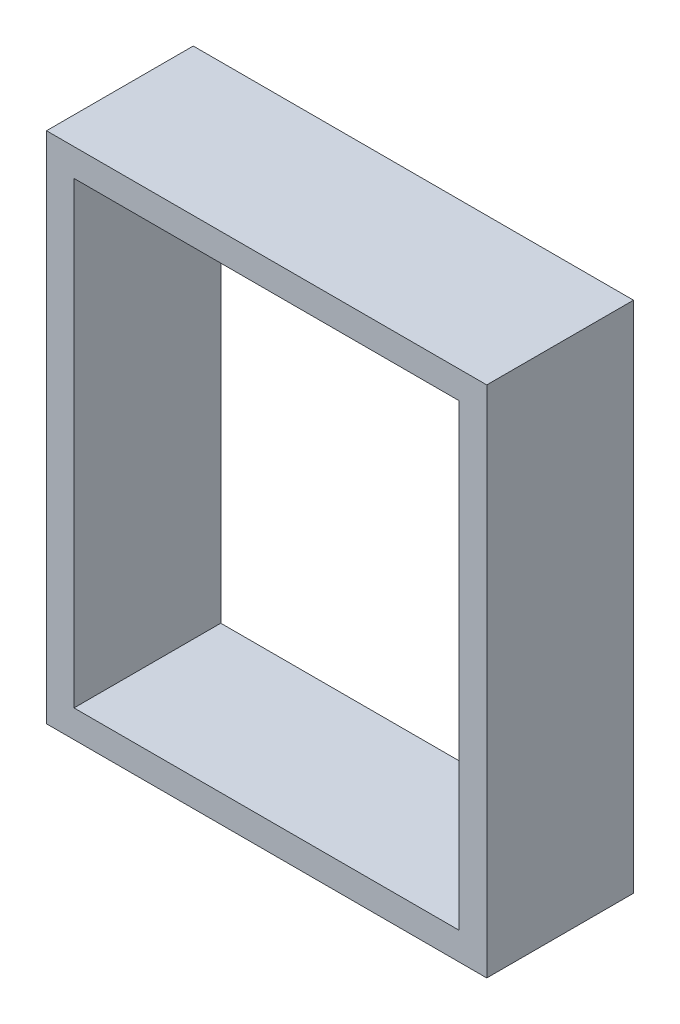
ISO-10303-21;
HEADER;
FILE_DESCRIPTION(('STEP AP214'),'2;1');
FILE_NAME('part.step','',(''),(''),'','','');
FILE_SCHEMA(('AUTOMOTIVE_DESIGN { 1 0 10303 214 1 1 1 1 }'));
ENDSEC;
DATA;
#1=APPLICATION_CONTEXT('core data for automotive mechanical design processes');
#2=APPLICATION_PROTOCOL_DEFINITION('international standard','automotive_design',2000,#1);
#3=PRODUCT_CONTEXT('',#1,'mechanical');
#4=PRODUCT('Part','Part','',(#3));
#5=PRODUCT_RELATED_PRODUCT_CATEGORY('part','',(#4));
#6=PRODUCT_DEFINITION_FORMATION('','',#4);
#7=PRODUCT_DEFINITION_CONTEXT('part definition',#1,'design');
#8=PRODUCT_DEFINITION('design','',#6,#7);
#9=PRODUCT_DEFINITION_SHAPE('','',#8);
#10=(LENGTH_UNIT() NAMED_UNIT(*) SI_UNIT(.MILLI.,.METRE.));
#11=(NAMED_UNIT(*) PLANE_ANGLE_UNIT() SI_UNIT($,.RADIAN.));
#12=(NAMED_UNIT(*) SI_UNIT($,.STERADIAN.) SOLID_ANGLE_UNIT());
#13=UNCERTAINTY_MEASURE_WITH_UNIT(LENGTH_MEASURE(1.E-05),#10,'distance_accuracy_value','');
#14=(GEOMETRIC_REPRESENTATION_CONTEXT(3) GLOBAL_UNCERTAINTY_ASSIGNED_CONTEXT((#13)) GLOBAL_UNIT_ASSIGNED_CONTEXT((#10,
#11,#12)) REPRESENTATION_CONTEXT('',''));
#15=CARTESIAN_POINT('',(0.,0.,0.));
#16=DIRECTION('',(0.,0.,1.));
#17=DIRECTION('',(1.,0.,0.));
#18=AXIS2_PLACEMENT_3D('',#15,#16,#17);
#19=CARTESIAN_POINT('',(0.,0.,25.4));
#20=DIRECTION('',(0.,0.,1.));
#21=DIRECTION('',(1.,0.,0.));
#22=AXIS2_PLACEMENT_3D('',#19,#20,#21);
#23=PLANE('',#22);
#24=DIRECTION('',(0.,-1.,0.));
#25=VECTOR('',#24,1.);
#26=CARTESIAN_POINT('',(-38.1,44.45,25.4));
#27=LINE('',#26,#25);
#28=CARTESIAN_POINT('',(-38.1,44.45,25.4));
#29=VERTEX_POINT('',#28);
#30=CARTESIAN_POINT('',(-38.1,-44.45,25.4));
#31=VERTEX_POINT('',#30);
#32=EDGE_CURVE('E136',#29,#31,#27,.T.);
#33=ORIENTED_EDGE('',*,*,#32,.T.);
#34=DIRECTION('',(1.,0.,0.));
#35=VECTOR('',#34,1.);
#36=CARTESIAN_POINT('',(-38.1,-44.45,25.4));
#37=LINE('',#36,#35);
#38=CARTESIAN_POINT('',(38.1,-44.45,25.4));
#39=VERTEX_POINT('',#38);
#40=EDGE_CURVE('E139',#31,#39,#37,.T.);
#41=ORIENTED_EDGE('',*,*,#40,.T.);
#42=DIRECTION('',(0.,1.,0.));
#43=VECTOR('',#42,1.);
#44=CARTESIAN_POINT('',(38.1,44.45,25.4));
#45=LINE('',#44,#43);
#46=CARTESIAN_POINT('',(38.1,44.45,25.4));
#47=VERTEX_POINT('',#46);
#48=EDGE_CURVE('E142',#39,#47,#45,.T.);
#49=ORIENTED_EDGE('',*,*,#48,.T.);
#50=DIRECTION('',(-1.,0.,0.));
#51=VECTOR('',#50,1.);
#52=CARTESIAN_POINT('',(-38.1,44.45,25.4));
#53=LINE('',#52,#51);
#54=EDGE_CURVE('E144',#47,#29,#53,.T.);
#55=ORIENTED_EDGE('',*,*,#54,.T.);
#56=EDGE_LOOP('',(#33,#41,#49,#55));
#57=FACE_BOUND('',#56,.T.);
#58=DIRECTION('',(1.,0.,0.));
#59=VECTOR('',#58,1.);
#60=CARTESIAN_POINT('',(-33.3375,-39.6875,25.4));
#61=LINE('',#60,#59);
#62=CARTESIAN_POINT('',(-33.3375,-39.6875,25.4));
#63=VERTEX_POINT('',#62);
#64=CARTESIAN_POINT('',(33.3375,-39.6875,25.4));
#65=VERTEX_POINT('',#64);
#66=EDGE_CURVE('E108',#63,#65,#61,.T.);
#67=ORIENTED_EDGE('',*,*,#66,.F.);
#68=DIRECTION('',(0.,-1.,0.));
#69=VECTOR('',#68,1.);
#70=CARTESIAN_POINT('',(-33.3375,39.6875,25.4));
#71=LINE('',#70,#69);
#72=CARTESIAN_POINT('',(-33.3375,39.6875,25.4));
#73=VERTEX_POINT('',#72);
#74=EDGE_CURVE('E100',#73,#63,#71,.T.);
#75=ORIENTED_EDGE('',*,*,#74,.F.);
#76=DIRECTION('',(-1.,0.,0.));
#77=VECTOR('',#76,1.);
#78=CARTESIAN_POINT('',(-33.3375,39.6875,25.4));
#79=LINE('',#78,#77);
#80=CARTESIAN_POINT('',(33.3375,39.6875,25.4));
#81=VERTEX_POINT('',#80);
#82=EDGE_CURVE('E122',#81,#73,#79,.T.);
#83=ORIENTED_EDGE('',*,*,#82,.F.);
#84=DIRECTION('',(0.,1.,0.));
#85=VECTOR('',#84,1.);
#86=CARTESIAN_POINT('',(33.3375,39.6875,25.4));
#87=LINE('',#86,#85);
#88=EDGE_CURVE('E120',#65,#81,#87,.T.);
#89=ORIENTED_EDGE('',*,*,#88,.F.);
#90=EDGE_LOOP('',(#67,#75,#83,#89));
#91=FACE_BOUND('',#90,.T.);
#92=ADVANCED_FACE('F35',(#57,#91),#23,.T.);
#93=CARTESIAN_POINT('',(0.,0.,0.));
#94=DIRECTION('',(0.,0.,1.));
#95=DIRECTION('',(1.,0.,0.));
#96=AXIS2_PLACEMENT_3D('',#93,#94,#95);
#97=PLANE('',#96);
#98=DIRECTION('',(0.,-1.,0.));
#99=VECTOR('',#98,1.);
#100=CARTESIAN_POINT('',(-38.1,44.45,0.));
#101=LINE('',#100,#99);
#102=CARTESIAN_POINT('',(-38.1,44.45,0.));
#103=VERTEX_POINT('',#102);
#104=CARTESIAN_POINT('',(-38.1,-44.45,0.));
#105=VERTEX_POINT('',#104);
#106=EDGE_CURVE('E116',#103,#105,#101,.T.);
#107=ORIENTED_EDGE('',*,*,#106,.F.);
#108=DIRECTION('',(-1.,0.,0.));
#109=VECTOR('',#108,1.);
#110=CARTESIAN_POINT('',(-38.1,44.45,0.));
#111=LINE('',#110,#109);
#112=CARTESIAN_POINT('',(38.1,44.45,0.));
#113=VERTEX_POINT('',#112);
#114=EDGE_CURVE('E140',#113,#103,#111,.T.);
#115=ORIENTED_EDGE('',*,*,#114,.F.);
#116=DIRECTION('',(0.,1.,0.));
#117=VECTOR('',#116,1.);
#118=CARTESIAN_POINT('',(38.1,44.45,0.));
#119=LINE('',#118,#117);
#120=CARTESIAN_POINT('',(38.1,-44.45,0.));
#121=VERTEX_POINT('',#120);
#122=EDGE_CURVE('E151',#121,#113,#119,.T.);
#123=ORIENTED_EDGE('',*,*,#122,.F.);
#124=DIRECTION('',(1.,0.,0.));
#125=VECTOR('',#124,1.);
#126=CARTESIAN_POINT('',(-38.1,-44.45,0.));
#127=LINE('',#126,#125);
#128=EDGE_CURVE('E149',#105,#121,#127,.T.);
#129=ORIENTED_EDGE('',*,*,#128,.F.);
#130=EDGE_LOOP('',(#107,#115,#123,#129));
#131=FACE_BOUND('',#130,.T.);
#132=DIRECTION('',(0.,-1.,0.));
#133=VECTOR('',#132,1.);
#134=CARTESIAN_POINT('',(-33.3375,39.6875,0.));
#135=LINE('',#134,#133);
#136=CARTESIAN_POINT('',(-33.3375,39.6875,0.));
#137=VERTEX_POINT('',#136);
#138=CARTESIAN_POINT('',(-33.3375,-39.6875,0.));
#139=VERTEX_POINT('',#138);
#140=EDGE_CURVE('E58',#137,#139,#135,.T.);
#141=ORIENTED_EDGE('',*,*,#140,.T.);
#142=DIRECTION('',(1.,0.,0.));
#143=VECTOR('',#142,1.);
#144=CARTESIAN_POINT('',(-33.3375,-39.6875,0.));
#145=LINE('',#144,#143);
#146=CARTESIAN_POINT('',(33.3375,-39.6875,0.));
#147=VERTEX_POINT('',#146);
#148=EDGE_CURVE('E115',#139,#147,#145,.T.);
#149=ORIENTED_EDGE('',*,*,#148,.T.);
#150=DIRECTION('',(0.,1.,0.));
#151=VECTOR('',#150,1.);
#152=CARTESIAN_POINT('',(33.3375,39.6875,0.));
#153=LINE('',#152,#151);
#154=CARTESIAN_POINT('',(33.3375,39.6875,0.));
#155=VERTEX_POINT('',#154);
#156=EDGE_CURVE('E128',#147,#155,#153,.T.);
#157=ORIENTED_EDGE('',*,*,#156,.T.);
#158=DIRECTION('',(-1.,0.,0.));
#159=VECTOR('',#158,1.);
#160=CARTESIAN_POINT('',(-33.3375,39.6875,0.));
#161=LINE('',#160,#159);
#162=EDGE_CURVE('E109',#155,#137,#161,.T.);
#163=ORIENTED_EDGE('',*,*,#162,.T.);
#164=EDGE_LOOP('',(#141,#149,#157,#163));
#165=FACE_BOUND('',#164,.T.);
#166=ADVANCED_FACE('F169',(#131,#165),#97,.F.);
#167=CARTESIAN_POINT('',(-38.1,44.45,25.4));
#168=DIRECTION('',(1.,0.,0.));
#169=DIRECTION('',(0.,1.,0.));
#170=AXIS2_PLACEMENT_3D('',#167,#168,#169);
#171=PLANE('',#170);
#172=ORIENTED_EDGE('',*,*,#106,.T.);
#173=DIRECTION('',(0.,0.,-1.));
#174=VECTOR('',#173,1.);
#175=CARTESIAN_POINT('',(-38.1,-44.45,25.4));
#176=LINE('',#175,#174);
#177=EDGE_CURVE('E11',#31,#105,#176,.T.);
#178=ORIENTED_EDGE('',*,*,#177,.F.);
#179=ORIENTED_EDGE('',*,*,#32,.F.);
#180=DIRECTION('',(0.,0.,-1.));
#181=VECTOR('',#180,1.);
#182=CARTESIAN_POINT('',(-38.1,44.45,25.4));
#183=LINE('',#182,#181);
#184=EDGE_CURVE('E146',#29,#103,#183,.T.);
#185=ORIENTED_EDGE('',*,*,#184,.T.);
#186=EDGE_LOOP('',(#172,#178,#179,#185));
#187=FACE_BOUND('',#186,.T.);
#188=ADVANCED_FACE('F37',(#187),#171,.F.);
#189=CARTESIAN_POINT('',(-38.1,-44.45,25.4));
#190=DIRECTION('',(0.,1.,0.));
#191=DIRECTION('',(-1.,0.,0.));
#192=AXIS2_PLACEMENT_3D('',#189,#190,#191);
#193=PLANE('',#192);
#194=ORIENTED_EDGE('',*,*,#128,.T.);
#195=DIRECTION('',(0.,0.,-1.));
#196=VECTOR('',#195,1.);
#197=CARTESIAN_POINT('',(38.1,-44.45,25.4));
#198=LINE('',#197,#196);
#199=EDGE_CURVE('E43',#39,#121,#198,.T.);
#200=ORIENTED_EDGE('',*,*,#199,.F.);
#201=ORIENTED_EDGE('',*,*,#40,.F.);
#202=ORIENTED_EDGE('',*,*,#177,.T.);
#203=EDGE_LOOP('',(#194,#200,#201,#202));
#204=FACE_BOUND('',#203,.T.);
#205=ADVANCED_FACE('F179',(#204),#193,.F.);
#206=CARTESIAN_POINT('',(38.1,44.45,25.4));
#207=DIRECTION('',(-1.,0.,0.));
#208=DIRECTION('',(0.,-1.,0.));
#209=AXIS2_PLACEMENT_3D('',#206,#207,#208);
#210=PLANE('',#209);
#211=ORIENTED_EDGE('',*,*,#122,.T.);
#212=DIRECTION('',(0.,0.,-1.));
#213=VECTOR('',#212,1.);
#214=CARTESIAN_POINT('',(38.1,44.45,25.4));
#215=LINE('',#214,#213);
#216=EDGE_CURVE('E156',#47,#113,#215,.T.);
#217=ORIENTED_EDGE('',*,*,#216,.F.);
#218=ORIENTED_EDGE('',*,*,#48,.F.);
#219=ORIENTED_EDGE('',*,*,#199,.T.);
#220=EDGE_LOOP('',(#211,#217,#218,#219));
#221=FACE_BOUND('',#220,.T.);
#222=ADVANCED_FACE('F163',(#221),#210,.F.);
#223=CARTESIAN_POINT('',(-38.1,44.45,25.4));
#224=DIRECTION('',(0.,-1.,0.));
#225=DIRECTION('',(1.,0.,0.));
#226=AXIS2_PLACEMENT_3D('',#223,#224,#225);
#227=PLANE('',#226);
#228=ORIENTED_EDGE('',*,*,#114,.T.);
#229=ORIENTED_EDGE('',*,*,#184,.F.);
#230=ORIENTED_EDGE('',*,*,#54,.F.);
#231=ORIENTED_EDGE('',*,*,#216,.T.);
#232=EDGE_LOOP('',(#228,#229,#230,#231));
#233=FACE_BOUND('',#232,.T.);
#234=ADVANCED_FACE('F173',(#233),#227,.F.);
#235=CARTESIAN_POINT('',(-33.3375,39.6875,25.4));
#236=DIRECTION('',(1.,0.,0.));
#237=DIRECTION('',(0.,0.,-1.));
#238=AXIS2_PLACEMENT_3D('',#235,#236,#237);
#239=PLANE('',#238);
#240=ORIENTED_EDGE('',*,*,#140,.F.);
#241=DIRECTION('',(0.,0.,-1.));
#242=VECTOR('',#241,1.);
#243=CARTESIAN_POINT('',(-33.3375,39.6875,25.4));
#244=LINE('',#243,#242);
#245=EDGE_CURVE('E104',#73,#137,#244,.T.);
#246=ORIENTED_EDGE('',*,*,#245,.F.);
#247=ORIENTED_EDGE('',*,*,#74,.T.);
#248=DIRECTION('',(0.,0.,-1.));
#249=VECTOR('',#248,1.);
#250=CARTESIAN_POINT('',(-33.3375,-39.6875,25.4));
#251=LINE('',#250,#249);
#252=EDGE_CURVE('E103',#63,#139,#251,.T.);
#253=ORIENTED_EDGE('',*,*,#252,.T.);
#254=EDGE_LOOP('',(#240,#246,#247,#253));
#255=FACE_BOUND('',#254,.T.);
#256=ADVANCED_FACE('F102',(#255),#239,.T.);
#257=CARTESIAN_POINT('',(-33.3375,-39.6875,25.4));
#258=DIRECTION('',(0.,1.,0.));
#259=DIRECTION('',(0.,0.,1.));
#260=AXIS2_PLACEMENT_3D('',#257,#258,#259);
#261=PLANE('',#260);
#262=ORIENTED_EDGE('',*,*,#148,.F.);
#263=ORIENTED_EDGE('',*,*,#252,.F.);
#264=ORIENTED_EDGE('',*,*,#66,.T.);
#265=DIRECTION('',(0.,0.,-1.));
#266=VECTOR('',#265,1.);
#267=CARTESIAN_POINT('',(33.3375,-39.6875,25.4));
#268=LINE('',#267,#266);
#269=EDGE_CURVE('E117',#65,#147,#268,.T.);
#270=ORIENTED_EDGE('',*,*,#269,.T.);
#271=EDGE_LOOP('',(#262,#263,#264,#270));
#272=FACE_BOUND('',#271,.T.);
#273=ADVANCED_FACE('F112',(#272),#261,.T.);
#274=CARTESIAN_POINT('',(33.3375,39.6875,25.4));
#275=DIRECTION('',(-1.,0.,0.));
#276=DIRECTION('',(0.,0.,1.));
#277=AXIS2_PLACEMENT_3D('',#274,#275,#276);
#278=PLANE('',#277);
#279=ORIENTED_EDGE('',*,*,#156,.F.);
#280=ORIENTED_EDGE('',*,*,#269,.F.);
#281=ORIENTED_EDGE('',*,*,#88,.T.);
#282=DIRECTION('',(0.,0.,-1.));
#283=VECTOR('',#282,1.);
#284=CARTESIAN_POINT('',(33.3375,39.6875,25.4));
#285=LINE('',#284,#283);
#286=EDGE_CURVE('E50',#81,#155,#285,.T.);
#287=ORIENTED_EDGE('',*,*,#286,.T.);
#288=EDGE_LOOP('',(#279,#280,#281,#287));
#289=FACE_BOUND('',#288,.T.);
#290=ADVANCED_FACE('F202',(#289),#278,.T.);
#291=CARTESIAN_POINT('',(-33.3375,39.6875,25.4));
#292=DIRECTION('',(0.,-1.,0.));
#293=DIRECTION('',(0.,0.,-1.));
#294=AXIS2_PLACEMENT_3D('',#291,#292,#293);
#295=PLANE('',#294);
#296=ORIENTED_EDGE('',*,*,#162,.F.);
#297=ORIENTED_EDGE('',*,*,#286,.F.);
#298=ORIENTED_EDGE('',*,*,#82,.T.);
#299=ORIENTED_EDGE('',*,*,#245,.T.);
#300=EDGE_LOOP('',(#296,#297,#298,#299));
#301=FACE_BOUND('',#300,.T.);
#302=ADVANCED_FACE('F206',(#301),#295,.T.);
#303=CLOSED_SHELL('',(#92,#166,#188,#205,#222,#234,#256,#273,#290,#302));
#304=MANIFOLD_SOLID_BREP('B2',#303);
#305=ADVANCED_BREP_SHAPE_REPRESENTATION('',(#18,#304),#14);
#306=SHAPE_DEFINITION_REPRESENTATION(#9,#305);
ENDSEC;
END-ISO-10303-21;
